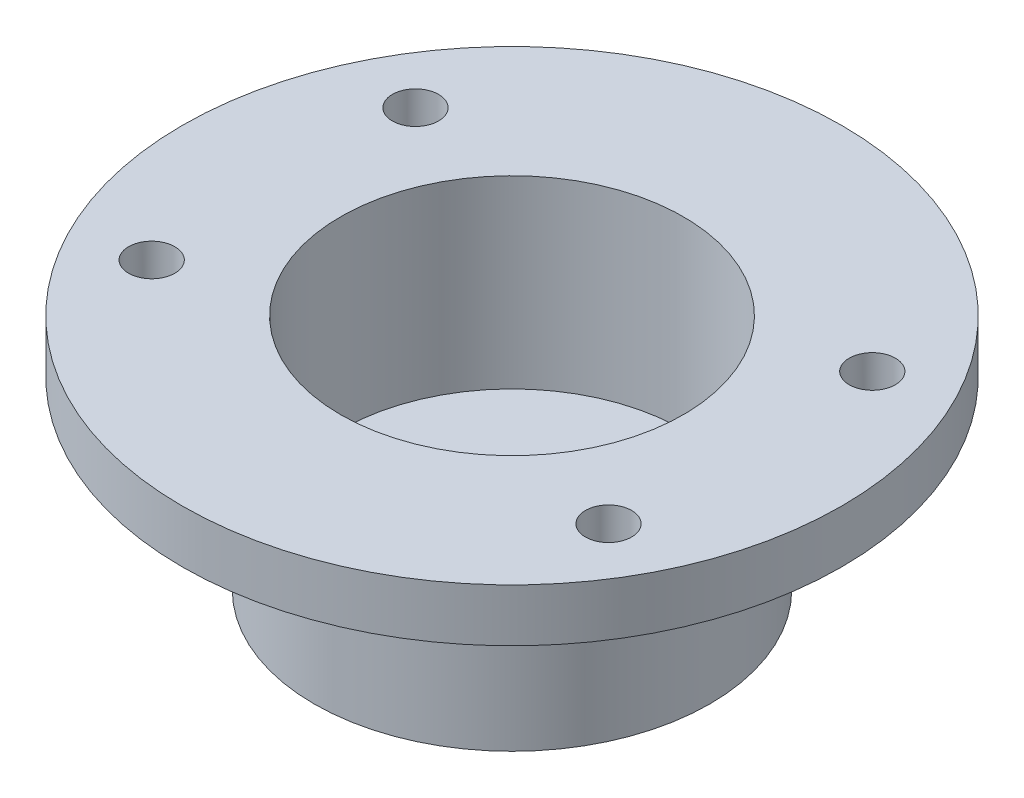
ISO-10303-21;
HEADER;
FILE_DESCRIPTION(('STEP AP214'),'2;1');
FILE_NAME('part.step','',(''),(''),'','','');
FILE_SCHEMA(('AUTOMOTIVE_DESIGN { 1 0 10303 214 1 1 1 1 }'));
ENDSEC;
DATA;
#1=APPLICATION_CONTEXT('core data for automotive mechanical design processes');
#2=APPLICATION_PROTOCOL_DEFINITION('international standard','automotive_design',2000,#1);
#3=PRODUCT_CONTEXT('',#1,'mechanical');
#4=PRODUCT('Part','Part','',(#3));
#5=PRODUCT_RELATED_PRODUCT_CATEGORY('part','',(#4));
#6=PRODUCT_DEFINITION_FORMATION('','',#4);
#7=PRODUCT_DEFINITION_CONTEXT('part definition',#1,'design');
#8=PRODUCT_DEFINITION('design','',#6,#7);
#9=PRODUCT_DEFINITION_SHAPE('','',#8);
#10=(LENGTH_UNIT() NAMED_UNIT(*) SI_UNIT(.MILLI.,.METRE.));
#11=(NAMED_UNIT(*) PLANE_ANGLE_UNIT() SI_UNIT($,.RADIAN.));
#12=(NAMED_UNIT(*) SI_UNIT($,.STERADIAN.) SOLID_ANGLE_UNIT());
#13=UNCERTAINTY_MEASURE_WITH_UNIT(LENGTH_MEASURE(1.E-05),#10,'distance_accuracy_value','');
#14=(GEOMETRIC_REPRESENTATION_CONTEXT(3) GLOBAL_UNCERTAINTY_ASSIGNED_CONTEXT((#13)) GLOBAL_UNIT_ASSIGNED_CONTEXT((#10,
#11,#12)) REPRESENTATION_CONTEXT('',''));
#15=CARTESIAN_POINT('',(0.,0.,0.));
#16=DIRECTION('',(0.,0.,1.));
#17=DIRECTION('',(1.,0.,0.));
#18=AXIS2_PLACEMENT_3D('',#15,#16,#17);
#19=CARTESIAN_POINT('',(0.,4.,0.));
#20=DIRECTION('',(0.,1.,0.));
#21=DIRECTION('',(0.,0.,1.));
#22=AXIS2_PLACEMENT_3D('',#19,#20,#21);
#23=PLANE('',#22);
#24=CARTESIAN_POINT('',(0.,4.,0.));
#25=DIRECTION('',(0.,1.,0.));
#26=DIRECTION('',(0.,0.,1.));
#27=AXIS2_PLACEMENT_3D('',#24,#25,#26);
#28=CIRCLE('',#27,3.);
#29=CARTESIAN_POINT('',(0.,4.,3.));
#30=VERTEX_POINT('',#29);
#31=EDGE_CURVE('E51',#30,#30,#28,.T.);
#32=ORIENTED_EDGE('',*,*,#31,.F.);
#33=EDGE_LOOP('',(#32));
#34=FACE_BOUND('',#33,.T.);
#35=CARTESIAN_POINT('',(0.,4.,0.));
#36=DIRECTION('',(0.,1.,0.));
#37=DIRECTION('',(0.,0.,1.));
#38=AXIS2_PLACEMENT_3D('',#35,#36,#37);
#39=CIRCLE('',#38,13.);
#40=CARTESIAN_POINT('',(0.,4.,13.));
#41=VERTEX_POINT('',#40);
#42=EDGE_CURVE('E11',#41,#41,#39,.F.);
#43=ORIENTED_EDGE('',*,*,#42,.F.);
#44=EDGE_LOOP('',(#43));
#45=FACE_BOUND('',#44,.T.);
#46=ADVANCED_FACE('F40',(#34,#45),#23,.T.);
#47=CARTESIAN_POINT('',(0.,0.,0.));
#48=DIRECTION('',(0.,1.,0.));
#49=DIRECTION('',(0.,0.,1.));
#50=AXIS2_PLACEMENT_3D('',#47,#48,#49);
#51=PLANE('',#50);
#52=CARTESIAN_POINT('',(0.,0.,0.));
#53=DIRECTION('',(0.,1.,0.));
#54=DIRECTION('',(0.,0.,1.));
#55=AXIS2_PLACEMENT_3D('',#52,#53,#54);
#56=CIRCLE('',#55,15.);
#57=CARTESIAN_POINT('',(0.,0.,15.));
#58=VERTEX_POINT('',#57);
#59=EDGE_CURVE('E47',#58,#58,#56,.T.);
#60=ORIENTED_EDGE('',*,*,#59,.F.);
#61=EDGE_LOOP('',(#60));
#62=FACE_BOUND('',#61,.T.);
#63=CARTESIAN_POINT('',(0.,0.,0.));
#64=DIRECTION('',(0.,1.,0.));
#65=DIRECTION('',(0.,0.,1.));
#66=AXIS2_PLACEMENT_3D('',#63,#64,#65);
#67=CIRCLE('',#66,3.);
#68=CARTESIAN_POINT('',(0.,0.,3.));
#69=VERTEX_POINT('',#68);
#70=EDGE_CURVE('E55',#69,#69,#67,.T.);
#71=ORIENTED_EDGE('',*,*,#70,.T.);
#72=EDGE_LOOP('',(#71));
#73=FACE_BOUND('',#72,.T.);
#74=ADVANCED_FACE('F123',(#62,#73),#51,.F.);
#75=CARTESIAN_POINT('',(0.,4.,0.));
#76=DIRECTION('',(0.,-1.,0.));
#77=DIRECTION('',(0.,0.,-1.));
#78=AXIS2_PLACEMENT_3D('',#75,#76,#77);
#79=CYLINDRICAL_SURFACE('',#78,15.);
#80=ORIENTED_EDGE('',*,*,#59,.T.);
#81=EDGE_LOOP('',(#80));
#82=FACE_BOUND('',#81,.T.);
#83=CARTESIAN_POINT('',(0.,14.,0.));
#84=DIRECTION('',(0.,1.,0.));
#85=DIRECTION('',(0.,0.,1.));
#86=AXIS2_PLACEMENT_3D('',#83,#84,#85);
#87=CIRCLE('',#86,15.);
#88=CARTESIAN_POINT('',(0.,14.,15.));
#89=VERTEX_POINT('',#88);
#90=EDGE_CURVE('E59',#89,#89,#87,.T.);
#91=ORIENTED_EDGE('',*,*,#90,.F.);
#92=EDGE_LOOP('',(#91));
#93=FACE_BOUND('',#92,.T.);
#94=ADVANCED_FACE('F42',(#82,#93),#79,.T.);
#95=CARTESIAN_POINT('',(0.,4.,0.));
#96=DIRECTION('',(0.,-1.,0.));
#97=DIRECTION('',(0.,0.,-1.));
#98=AXIS2_PLACEMENT_3D('',#95,#96,#97);
#99=CYLINDRICAL_SURFACE('',#98,3.);
#100=ORIENTED_EDGE('',*,*,#31,.T.);
#101=EDGE_LOOP('',(#100));
#102=FACE_BOUND('',#101,.T.);
#103=ORIENTED_EDGE('',*,*,#70,.F.);
#104=EDGE_LOOP('',(#103));
#105=FACE_BOUND('',#104,.T.);
#106=ADVANCED_FACE('F114',(#102,#105),#99,.F.);
#107=CARTESIAN_POINT('',(0.,14.,0.));
#108=DIRECTION('',(0.,-1.,0.));
#109=DIRECTION('',(0.,0.,-1.));
#110=AXIS2_PLACEMENT_3D('',#107,#108,#109);
#111=CYLINDRICAL_SURFACE('',#110,13.);
#112=ORIENTED_EDGE('',*,*,#42,.T.);
#113=EDGE_LOOP('',(#112));
#114=FACE_BOUND('',#113,.T.);
#115=CARTESIAN_POINT('',(0.,18.,0.));
#116=DIRECTION('',(0.,1.,0.));
#117=DIRECTION('',(0.,0.,1.));
#118=AXIS2_PLACEMENT_3D('',#115,#116,#117);
#119=CIRCLE('',#118,13.);
#120=CARTESIAN_POINT('',(0.,18.,13.));
#121=VERTEX_POINT('',#120);
#122=EDGE_CURVE('E67',#121,#121,#119,.T.);
#123=ORIENTED_EDGE('',*,*,#122,.T.);
#124=EDGE_LOOP('',(#123));
#125=FACE_BOUND('',#124,.T.);
#126=ADVANCED_FACE('F104',(#114,#125),#111,.F.);
#127=CARTESIAN_POINT('',(0.,18.,0.));
#128=DIRECTION('',(0.,1.,0.));
#129=DIRECTION('',(0.,0.,1.));
#130=AXIS2_PLACEMENT_3D('',#127,#128,#129);
#131=PLANE('',#130);
#132=CARTESIAN_POINT('',(-17.3205080756888,18.,9.99999999999996));
#133=DIRECTION('',(0.,1.,0.));
#134=DIRECTION('',(0.,0.,-1.));
#135=AXIS2_PLACEMENT_3D('',#132,#133,#134);
#136=CIRCLE('',#135,1.75);
#137=CARTESIAN_POINT('',(-17.3205080756888,18.,8.24999999999996));
#138=VERTEX_POINT('',#137);
#139=EDGE_CURVE('E83',#138,#138,#136,.T.);
#140=ORIENTED_EDGE('',*,*,#139,.F.);
#141=EDGE_LOOP('',(#140));
#142=FACE_BOUND('',#141,.T.);
#143=CARTESIAN_POINT('',(17.3205080756888,18.,9.99999999999995));
#144=DIRECTION('',(0.,1.,0.));
#145=DIRECTION('',(0.,0.,1.));
#146=AXIS2_PLACEMENT_3D('',#143,#144,#145);
#147=CIRCLE('',#146,1.75);
#148=CARTESIAN_POINT('',(17.3205080756888,18.,11.7499999999999));
#149=VERTEX_POINT('',#148);
#150=EDGE_CURVE('E82',#149,#149,#147,.T.);
#151=ORIENTED_EDGE('',*,*,#150,.F.);
#152=EDGE_LOOP('',(#151));
#153=FACE_BOUND('',#152,.T.);
#154=CARTESIAN_POINT('',(17.3205080756888,18.,-9.99999999999995));
#155=DIRECTION('',(0.,1.,0.));
#156=DIRECTION('',(0.,0.,-1.));
#157=AXIS2_PLACEMENT_3D('',#154,#155,#156);
#158=CIRCLE('',#157,1.75);
#159=CARTESIAN_POINT('',(17.3205080756888,18.,-11.7499999999999));
#160=VERTEX_POINT('',#159);
#161=EDGE_CURVE('E89',#160,#160,#158,.T.);
#162=ORIENTED_EDGE('',*,*,#161,.F.);
#163=EDGE_LOOP('',(#162));
#164=FACE_BOUND('',#163,.T.);
#165=CARTESIAN_POINT('',(-17.3205080756888,18.,-9.99999999999995));
#166=DIRECTION('',(0.,1.,0.));
#167=DIRECTION('',(0.,0.,1.));
#168=AXIS2_PLACEMENT_3D('',#165,#166,#167);
#169=CIRCLE('',#168,1.75);
#170=CARTESIAN_POINT('',(-17.3205080756888,18.,-8.24999999999995));
#171=VERTEX_POINT('',#170);
#172=EDGE_CURVE('E75',#171,#171,#169,.T.);
#173=ORIENTED_EDGE('',*,*,#172,.F.);
#174=EDGE_LOOP('',(#173));
#175=FACE_BOUND('',#174,.T.);
#176=CARTESIAN_POINT('',(0.,18.,0.));
#177=DIRECTION('',(0.,1.,0.));
#178=DIRECTION('',(0.,0.,1.));
#179=AXIS2_PLACEMENT_3D('',#176,#177,#178);
#180=CIRCLE('',#179,25.);
#181=CARTESIAN_POINT('',(0.,18.,25.));
#182=VERTEX_POINT('',#181);
#183=EDGE_CURVE('E63',#182,#182,#180,.T.);
#184=ORIENTED_EDGE('',*,*,#183,.T.);
#185=EDGE_LOOP('',(#184));
#186=FACE_BOUND('',#185,.T.);
#187=ORIENTED_EDGE('',*,*,#122,.F.);
#188=EDGE_LOOP('',(#187));
#189=FACE_BOUND('',#188,.T.);
#190=ADVANCED_FACE('F100',(#142,#153,#164,#175,#186,#189),#131,.T.);
#191=CARTESIAN_POINT('',(0.,14.,0.));
#192=DIRECTION('',(0.,1.,0.));
#193=DIRECTION('',(0.,0.,1.));
#194=AXIS2_PLACEMENT_3D('',#191,#192,#193);
#195=PLANE('',#194);
#196=CARTESIAN_POINT('',(-17.3205080756888,14.,9.99999999999996));
#197=DIRECTION('',(0.,1.,0.));
#198=DIRECTION('',(0.,0.,1.));
#199=AXIS2_PLACEMENT_3D('',#196,#197,#198);
#200=CIRCLE('',#199,1.75);
#201=CARTESIAN_POINT('',(-17.3205080756888,14.,11.75));
#202=VERTEX_POINT('',#201);
#203=EDGE_CURVE('E79',#202,#202,#200,.F.);
#204=ORIENTED_EDGE('',*,*,#203,.F.);
#205=EDGE_LOOP('',(#204));
#206=FACE_BOUND('',#205,.T.);
#207=CARTESIAN_POINT('',(17.3205080756888,14.,9.99999999999995));
#208=DIRECTION('',(0.,1.,0.));
#209=DIRECTION('',(0.,0.,1.));
#210=AXIS2_PLACEMENT_3D('',#207,#208,#209);
#211=CIRCLE('',#210,1.75);
#212=CARTESIAN_POINT('',(17.3205080756888,14.,11.7499999999999));
#213=VERTEX_POINT('',#212);
#214=EDGE_CURVE('E86',#213,#213,#211,.F.);
#215=ORIENTED_EDGE('',*,*,#214,.F.);
#216=EDGE_LOOP('',(#215));
#217=FACE_BOUND('',#216,.T.);
#218=CARTESIAN_POINT('',(17.3205080756888,14.,-9.99999999999995));
#219=DIRECTION('',(0.,1.,0.));
#220=DIRECTION('',(0.,0.,1.));
#221=AXIS2_PLACEMENT_3D('',#218,#219,#220);
#222=CIRCLE('',#221,1.75);
#223=CARTESIAN_POINT('',(17.3205080756888,14.,-8.24999999999995));
#224=VERTEX_POINT('',#223);
#225=EDGE_CURVE('E78',#224,#224,#222,.F.);
#226=ORIENTED_EDGE('',*,*,#225,.F.);
#227=EDGE_LOOP('',(#226));
#228=FACE_BOUND('',#227,.T.);
#229=CARTESIAN_POINT('',(-17.3205080756888,14.,-9.99999999999995));
#230=DIRECTION('',(0.,1.,0.));
#231=DIRECTION('',(0.,0.,1.));
#232=AXIS2_PLACEMENT_3D('',#229,#230,#231);
#233=CIRCLE('',#232,1.75);
#234=CARTESIAN_POINT('',(-17.3205080756888,14.,-8.24999999999995));
#235=VERTEX_POINT('',#234);
#236=EDGE_CURVE('E72',#235,#235,#233,.F.);
#237=ORIENTED_EDGE('',*,*,#236,.F.);
#238=EDGE_LOOP('',(#237));
#239=FACE_BOUND('',#238,.T.);
#240=ORIENTED_EDGE('',*,*,#90,.T.);
#241=EDGE_LOOP('',(#240));
#242=FACE_BOUND('',#241,.T.);
#243=CARTESIAN_POINT('',(0.,14.,0.));
#244=DIRECTION('',(0.,1.,0.));
#245=DIRECTION('',(0.,0.,1.));
#246=AXIS2_PLACEMENT_3D('',#243,#244,#245);
#247=CIRCLE('',#246,25.);
#248=CARTESIAN_POINT('',(0.,14.,25.));
#249=VERTEX_POINT('',#248);
#250=EDGE_CURVE('E64',#249,#249,#247,.T.);
#251=ORIENTED_EDGE('',*,*,#250,.F.);
#252=EDGE_LOOP('',(#251));
#253=FACE_BOUND('',#252,.T.);
#254=ADVANCED_FACE('F103',(#206,#217,#228,#239,#242,#253),#195,.F.);
#255=CARTESIAN_POINT('',(0.,18.,0.));
#256=DIRECTION('',(0.,-1.,0.));
#257=DIRECTION('',(0.,0.,-1.));
#258=AXIS2_PLACEMENT_3D('',#255,#256,#257);
#259=CYLINDRICAL_SURFACE('',#258,25.);
#260=ORIENTED_EDGE('',*,*,#183,.F.);
#261=EDGE_LOOP('',(#260));
#262=FACE_BOUND('',#261,.T.);
#263=ORIENTED_EDGE('',*,*,#250,.T.);
#264=EDGE_LOOP('',(#263));
#265=FACE_BOUND('',#264,.T.);
#266=ADVANCED_FACE('F145',(#262,#265),#259,.T.);
#267=CARTESIAN_POINT('',(-17.3205080756888,-0.001000000000001,-9.99999999999995));
#268=DIRECTION('',(0.,1.,0.));
#269=DIRECTION('',(0.,0.,1.));
#270=AXIS2_PLACEMENT_3D('',#267,#268,#269);
#271=CYLINDRICAL_SURFACE('',#270,1.75);
#272=ORIENTED_EDGE('',*,*,#172,.T.);
#273=EDGE_LOOP('',(#272));
#274=FACE_BOUND('',#273,.T.);
#275=ORIENTED_EDGE('',*,*,#236,.T.);
#276=EDGE_LOOP('',(#275));
#277=FACE_BOUND('',#276,.T.);
#278=ADVANCED_FACE('F151',(#274,#277),#271,.F.);
#279=CARTESIAN_POINT('',(17.3205080756888,-0.001000000000001,-9.99999999999995));
#280=DIRECTION('',(0.,1.,0.));
#281=DIRECTION('',(0.,0.,1.));
#282=AXIS2_PLACEMENT_3D('',#279,#280,#281);
#283=CYLINDRICAL_SURFACE('',#282,1.75);
#284=ORIENTED_EDGE('',*,*,#161,.T.);
#285=EDGE_LOOP('',(#284));
#286=FACE_BOUND('',#285,.T.);
#287=ORIENTED_EDGE('',*,*,#225,.T.);
#288=EDGE_LOOP('',(#287));
#289=FACE_BOUND('',#288,.T.);
#290=ADVANCED_FACE('F97',(#286,#289),#283,.F.);
#291=CARTESIAN_POINT('',(17.3205080756888,-0.001000000000001,9.99999999999995));
#292=DIRECTION('',(0.,1.,0.));
#293=DIRECTION('',(0.,0.,1.));
#294=AXIS2_PLACEMENT_3D('',#291,#292,#293);
#295=CYLINDRICAL_SURFACE('',#294,1.75);
#296=ORIENTED_EDGE('',*,*,#150,.T.);
#297=EDGE_LOOP('',(#296));
#298=FACE_BOUND('',#297,.T.);
#299=ORIENTED_EDGE('',*,*,#214,.T.);
#300=EDGE_LOOP('',(#299));
#301=FACE_BOUND('',#300,.T.);
#302=ADVANCED_FACE('F162',(#298,#301),#295,.F.);
#303=CARTESIAN_POINT('',(-17.3205080756888,-0.001000000000001,9.99999999999996));
#304=DIRECTION('',(0.,1.,0.));
#305=DIRECTION('',(0.,0.,1.));
#306=AXIS2_PLACEMENT_3D('',#303,#304,#305);
#307=CYLINDRICAL_SURFACE('',#306,1.75);
#308=ORIENTED_EDGE('',*,*,#139,.T.);
#309=EDGE_LOOP('',(#308));
#310=FACE_BOUND('',#309,.T.);
#311=ORIENTED_EDGE('',*,*,#203,.T.);
#312=EDGE_LOOP('',(#311));
#313=FACE_BOUND('',#312,.T.);
#314=ADVANCED_FACE('F159',(#310,#313),#307,.F.);
#315=CLOSED_SHELL('',(#46,#74,#94,#106,#126,#190,#254,#266,#278,#290,#302,#314));
#316=MANIFOLD_SOLID_BREP('B2',#315);
#317=ADVANCED_BREP_SHAPE_REPRESENTATION('',(#18,#316),#14);
#318=SHAPE_DEFINITION_REPRESENTATION(#9,#317);
ENDSEC;
END-ISO-10303-21;
